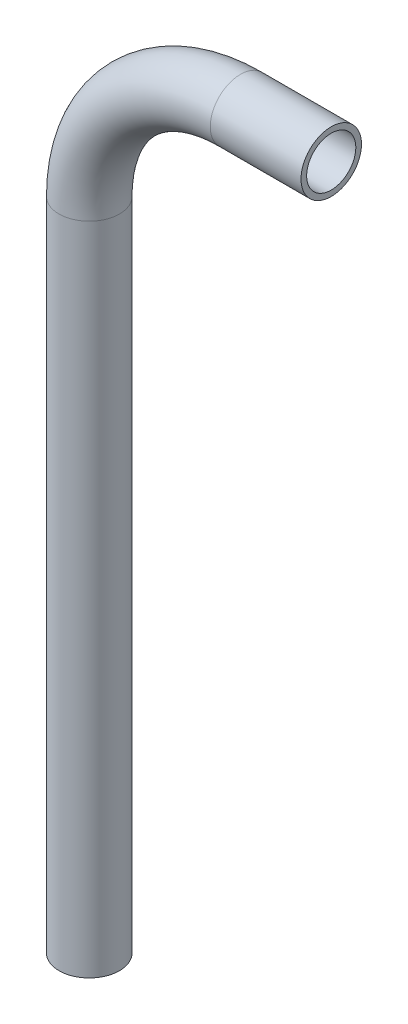
ISO-10303-21;
HEADER;
FILE_DESCRIPTION(('STEP AP214'),'2;1');
FILE_NAME('part.step','',(''),(''),'','','');
FILE_SCHEMA(('AUTOMOTIVE_DESIGN { 1 0 10303 214 1 1 1 1 }'));
ENDSEC;
DATA;
#1=APPLICATION_CONTEXT('core data for automotive mechanical design processes');
#2=APPLICATION_PROTOCOL_DEFINITION('international standard','automotive_design',2000,#1);
#3=PRODUCT_CONTEXT('',#1,'mechanical');
#4=PRODUCT('Part','Part','',(#3));
#5=PRODUCT_RELATED_PRODUCT_CATEGORY('part','',(#4));
#6=PRODUCT_DEFINITION_FORMATION('','',#4);
#7=PRODUCT_DEFINITION_CONTEXT('part definition',#1,'design');
#8=PRODUCT_DEFINITION('design','',#6,#7);
#9=PRODUCT_DEFINITION_SHAPE('','',#8);
#10=(LENGTH_UNIT() NAMED_UNIT(*) SI_UNIT(.MILLI.,.METRE.));
#11=(NAMED_UNIT(*) PLANE_ANGLE_UNIT() SI_UNIT($,.RADIAN.));
#12=(NAMED_UNIT(*) SI_UNIT($,.STERADIAN.) SOLID_ANGLE_UNIT());
#13=UNCERTAINTY_MEASURE_WITH_UNIT(LENGTH_MEASURE(1.E-05),#10,'distance_accuracy_value','');
#14=(GEOMETRIC_REPRESENTATION_CONTEXT(3) GLOBAL_UNCERTAINTY_ASSIGNED_CONTEXT((#13)) GLOBAL_UNIT_ASSIGNED_CONTEXT((#10,
#11,#12)) REPRESENTATION_CONTEXT('',''));
#15=CARTESIAN_POINT('',(0.,0.,0.));
#16=DIRECTION('',(0.,0.,1.));
#17=DIRECTION('',(1.,0.,0.));
#18=AXIS2_PLACEMENT_3D('',#15,#16,#17);
#19=CARTESIAN_POINT('',(0.,-127.,0.));
#20=DIRECTION('',(0.,1.,0.));
#21=DIRECTION('',(-1.,0.,0.));
#22=AXIS2_PLACEMENT_3D('',#19,#20,#21);
#23=CYLINDRICAL_SURFACE('',#22,4.7625);
#24=CARTESIAN_POINT('',(0.,-23.8125000000002,0.));
#25=DIRECTION('',(0.,1.,0.));
#26=DIRECTION('',(0.,0.,-1.));
#27=AXIS2_PLACEMENT_3D('',#24,#25,#26);
#28=CIRCLE('',#27,4.7625);
#29=CARTESIAN_POINT('',(-4.7625,-23.8125000000002,0.));
#30=VERTEX_POINT('',#29);
#31=EDGE_CURVE('E90',#30,#30,#28,.T.);
#32=ORIENTED_EDGE('',*,*,#31,.F.);
#33=EDGE_LOOP('',(#32));
#34=FACE_BOUND('',#33,.T.);
#35=CARTESIAN_POINT('',(0.,-127.,0.));
#36=DIRECTION('',(0.,1.,0.));
#37=DIRECTION('',(0.,0.,-1.));
#38=AXIS2_PLACEMENT_3D('',#35,#36,#37);
#39=CIRCLE('',#38,4.7625);
#40=CARTESIAN_POINT('',(0.,-127.,-4.7625));
#41=VERTEX_POINT('',#40);
#42=EDGE_CURVE('E55',#41,#41,#39,.T.);
#43=ORIENTED_EDGE('',*,*,#42,.T.);
#44=EDGE_LOOP('',(#43));
#45=FACE_BOUND('',#44,.T.);
#46=ADVANCED_FACE('F39',(#34,#45),#23,.T.);
#47=CARTESIAN_POINT('',(23.8125,-23.8125,0.));
#48=DIRECTION('',(0.,0.,-1.));
#49=DIRECTION('',(-1.,0.,0.));
#50=AXIS2_PLACEMENT_3D('',#47,#48,#49);
#51=TOROIDAL_SURFACE('',#50,23.8125,4.7625);
#52=CARTESIAN_POINT('',(23.8125000000002,2.66453525910038E-13,0.));
#53=DIRECTION('',(1.,0.,0.));
#54=DIRECTION('',(0.,0.,-1.));
#55=AXIS2_PLACEMENT_3D('',#52,#53,#54);
#56=CIRCLE('',#55,4.7625);
#57=CARTESIAN_POINT('',(23.8125000000002,4.7625,0.));
#58=VERTEX_POINT('',#57);
#59=EDGE_CURVE('E43',#58,#58,#56,.T.);
#60=CARTESIAN_POINT('',(23.8125,-23.8125,0.));
#61=DIRECTION('',(0.,0.,-1.));
#62=DIRECTION('',(-1.,0.,0.));
#63=AXIS2_PLACEMENT_3D('',#60,#61,#62);
#64=CIRCLE('',#63,28.575);
#65=EDGE_CURVE('',#30,#58,#64,.T.);
#66=ORIENTED_EDGE('',*,*,#31,.T.);
#67=ORIENTED_EDGE('',*,*,#59,.F.);
#68=ORIENTED_EDGE('',*,*,#65,.T.);
#69=ORIENTED_EDGE('',*,*,#65,.F.);
#70=EDGE_LOOP('',(#66,#68,#67,#69));
#71=FACE_BOUND('',#70,.T.);
#72=ADVANCED_FACE('F100',(#71),#51,.T.);
#73=CARTESIAN_POINT('',(23.8125000000002,0.,0.));
#74=DIRECTION('',(1.,0.,0.));
#75=DIRECTION('',(0.,0.,-1.));
#76=AXIS2_PLACEMENT_3D('',#73,#74,#75);
#77=CYLINDRICAL_SURFACE('',#76,4.7625);
#78=CARTESIAN_POINT('',(38.1,0.,0.));
#79=DIRECTION('',(1.,0.,0.));
#80=DIRECTION('',(0.,0.,-1.));
#81=AXIS2_PLACEMENT_3D('',#78,#79,#80);
#82=CIRCLE('',#81,4.7625);
#83=CARTESIAN_POINT('',(38.1,0.,-4.7625));
#84=VERTEX_POINT('',#83);
#85=EDGE_CURVE('E60',#84,#84,#82,.T.);
#86=ORIENTED_EDGE('',*,*,#85,.F.);
#87=EDGE_LOOP('',(#86));
#88=FACE_BOUND('',#87,.T.);
#89=ORIENTED_EDGE('',*,*,#59,.T.);
#90=EDGE_LOOP('',(#89));
#91=FACE_BOUND('',#90,.T.);
#92=ADVANCED_FACE('F41',(#88,#91),#77,.T.);
#93=CARTESIAN_POINT('',(0.,-127.,0.));
#94=DIRECTION('',(0.,1.,0.));
#95=DIRECTION('',(0.,0.,-1.));
#96=AXIS2_PLACEMENT_3D('',#93,#94,#95);
#97=PLANE('',#96);
#98=CARTESIAN_POINT('',(0.,-127.,0.));
#99=DIRECTION('',(0.,1.,0.));
#100=DIRECTION('',(0.,0.,-1.));
#101=AXIS2_PLACEMENT_3D('',#98,#99,#100);
#102=CIRCLE('',#101,3.8735);
#103=CARTESIAN_POINT('',(0.,-127.,-3.8735));
#104=VERTEX_POINT('',#103);
#105=EDGE_CURVE('E83',#104,#104,#102,.F.);
#106=ORIENTED_EDGE('',*,*,#105,.F.);
#107=EDGE_LOOP('',(#106));
#108=FACE_BOUND('',#107,.T.);
#109=ORIENTED_EDGE('',*,*,#42,.F.);
#110=EDGE_LOOP('',(#109));
#111=FACE_BOUND('',#110,.T.);
#112=ADVANCED_FACE('F106',(#108,#111),#97,.F.);
#113=CARTESIAN_POINT('',(38.1,0.,0.));
#114=DIRECTION('',(1.,0.,0.));
#115=DIRECTION('',(0.,0.,-1.));
#116=AXIS2_PLACEMENT_3D('',#113,#114,#115);
#117=PLANE('',#116);
#118=CARTESIAN_POINT('',(38.1,0.,0.));
#119=DIRECTION('',(1.,0.,0.));
#120=DIRECTION('',(0.,0.,-1.));
#121=AXIS2_PLACEMENT_3D('',#118,#119,#120);
#122=CIRCLE('',#121,3.8735);
#123=CARTESIAN_POINT('',(38.1,0.,-3.8735));
#124=VERTEX_POINT('',#123);
#125=EDGE_CURVE('E11',#124,#124,#122,.F.);
#126=ORIENTED_EDGE('',*,*,#125,.T.);
#127=EDGE_LOOP('',(#126));
#128=FACE_BOUND('',#127,.T.);
#129=ORIENTED_EDGE('',*,*,#85,.T.);
#130=EDGE_LOOP('',(#129));
#131=FACE_BOUND('',#130,.T.);
#132=ADVANCED_FACE('F67',(#128,#131),#117,.T.);
#133=CARTESIAN_POINT('',(0.,-127.,0.));
#134=DIRECTION('',(0.,1.,0.));
#135=DIRECTION('',(-1.,0.,0.));
#136=AXIS2_PLACEMENT_3D('',#133,#134,#135);
#137=CYLINDRICAL_SURFACE('',#136,3.8735);
#138=CARTESIAN_POINT('',(0.,-23.8125000000002,0.));
#139=DIRECTION('',(0.,1.,0.));
#140=DIRECTION('',(0.,0.,-1.));
#141=AXIS2_PLACEMENT_3D('',#138,#139,#140);
#142=CIRCLE('',#141,3.8735);
#143=CARTESIAN_POINT('',(-3.8735,-23.8125000000002,0.));
#144=VERTEX_POINT('',#143);
#145=EDGE_CURVE('E79',#144,#144,#142,.F.);
#146=ORIENTED_EDGE('',*,*,#145,.F.);
#147=EDGE_LOOP('',(#146));
#148=FACE_BOUND('',#147,.T.);
#149=ORIENTED_EDGE('',*,*,#105,.T.);
#150=EDGE_LOOP('',(#149));
#151=FACE_BOUND('',#150,.T.);
#152=ADVANCED_FACE('F114',(#148,#151),#137,.F.);
#153=CARTESIAN_POINT('',(23.8125,-23.8125,0.));
#154=DIRECTION('',(0.,0.,-1.));
#155=DIRECTION('',(-1.,0.,0.));
#156=AXIS2_PLACEMENT_3D('',#153,#154,#155);
#157=TOROIDAL_SURFACE('',#156,23.8125,3.8735);
#158=CARTESIAN_POINT('',(23.8125000000002,2.66453525910038E-13,0.));
#159=DIRECTION('',(1.,0.,0.));
#160=DIRECTION('',(0.,0.,-1.));
#161=AXIS2_PLACEMENT_3D('',#158,#159,#160);
#162=CIRCLE('',#161,3.8735);
#163=CARTESIAN_POINT('',(23.8125000000002,3.8735,0.));
#164=VERTEX_POINT('',#163);
#165=EDGE_CURVE('E49',#164,#164,#162,.F.);
#166=CARTESIAN_POINT('',(23.8125,-23.8125,0.));
#167=DIRECTION('',(0.,0.,-1.));
#168=DIRECTION('',(-1.,0.,0.));
#169=AXIS2_PLACEMENT_3D('',#166,#167,#168);
#170=CIRCLE('',#169,27.686);
#171=EDGE_CURVE('',#144,#164,#170,.T.);
#172=ORIENTED_EDGE('',*,*,#145,.T.);
#173=ORIENTED_EDGE('',*,*,#165,.F.);
#174=ORIENTED_EDGE('',*,*,#171,.T.);
#175=ORIENTED_EDGE('',*,*,#171,.F.);
#176=EDGE_LOOP('',(#172,#174,#173,#175));
#177=FACE_BOUND('',#176,.T.);
#178=ADVANCED_FACE('F73',(#177),#157,.F.);
#179=CARTESIAN_POINT('',(23.8125000000002,0.,0.));
#180=DIRECTION('',(1.,0.,0.));
#181=DIRECTION('',(0.,0.,-1.));
#182=AXIS2_PLACEMENT_3D('',#179,#180,#181);
#183=CYLINDRICAL_SURFACE('',#182,3.8735);
#184=ORIENTED_EDGE('',*,*,#125,.F.);
#185=EDGE_LOOP('',(#184));
#186=FACE_BOUND('',#185,.T.);
#187=ORIENTED_EDGE('',*,*,#165,.T.);
#188=EDGE_LOOP('',(#187));
#189=FACE_BOUND('',#188,.T.);
#190=ADVANCED_FACE('F70',(#186,#189),#183,.F.);
#191=CLOSED_SHELL('',(#46,#72,#92,#112,#132,#152,#178,#190));
#192=MANIFOLD_SOLID_BREP('B2',#191);
#193=ADVANCED_BREP_SHAPE_REPRESENTATION('',(#18,#192),#14);
#194=SHAPE_DEFINITION_REPRESENTATION(#9,#193);
ENDSEC;
END-ISO-10303-21;
